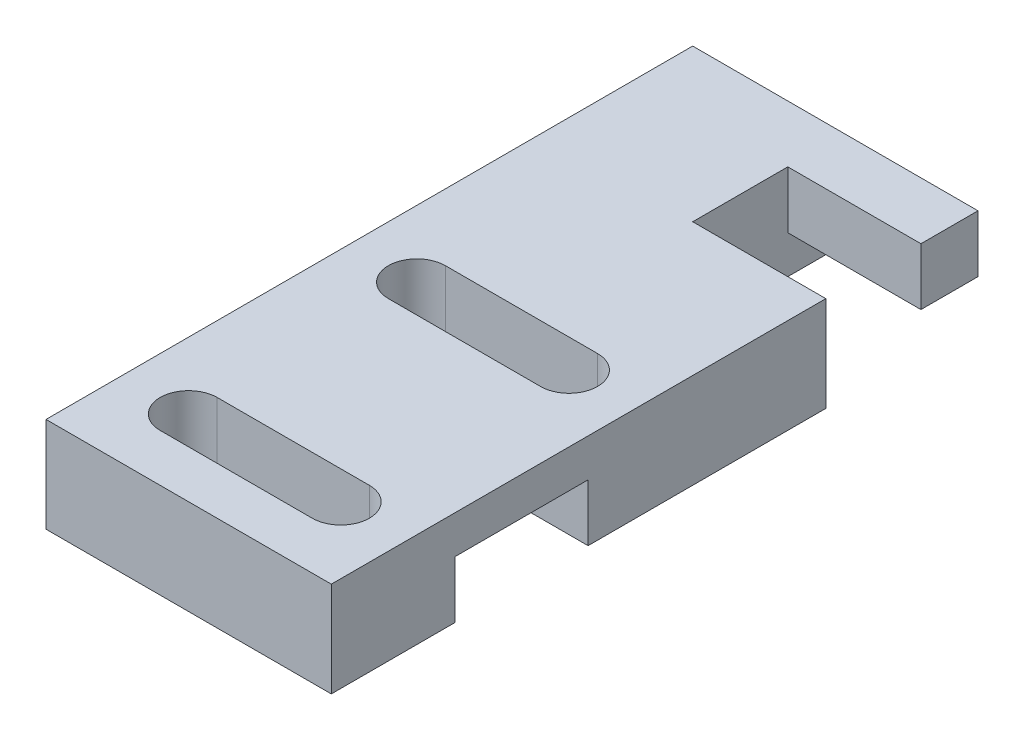
ISO-10303-21;
HEADER;
FILE_DESCRIPTION(('STEP AP214'),'2;1');
FILE_NAME('part.step','',(''),(''),'','','');
FILE_SCHEMA(('AUTOMOTIVE_DESIGN { 1 0 10303 214 1 1 1 1 }'));
ENDSEC;
DATA;
#1=APPLICATION_CONTEXT('core data for automotive mechanical design processes');
#2=APPLICATION_PROTOCOL_DEFINITION('international standard','automotive_design',2000,#1);
#3=PRODUCT_CONTEXT('',#1,'mechanical');
#4=PRODUCT('Part','Part','',(#3));
#5=PRODUCT_RELATED_PRODUCT_CATEGORY('part','',(#4));
#6=PRODUCT_DEFINITION_FORMATION('','',#4);
#7=PRODUCT_DEFINITION_CONTEXT('part definition',#1,'design');
#8=PRODUCT_DEFINITION('design','',#6,#7);
#9=PRODUCT_DEFINITION_SHAPE('','',#8);
#10=(LENGTH_UNIT() NAMED_UNIT(*) SI_UNIT(.MILLI.,.METRE.));
#11=(NAMED_UNIT(*) PLANE_ANGLE_UNIT() SI_UNIT($,.RADIAN.));
#12=(NAMED_UNIT(*) SI_UNIT($,.STERADIAN.) SOLID_ANGLE_UNIT());
#13=UNCERTAINTY_MEASURE_WITH_UNIT(LENGTH_MEASURE(1.E-05),#10,'distance_accuracy_value','');
#14=(GEOMETRIC_REPRESENTATION_CONTEXT(3) GLOBAL_UNCERTAINTY_ASSIGNED_CONTEXT((#13)) GLOBAL_UNIT_ASSIGNED_CONTEXT((#10,
#11,#12)) REPRESENTATION_CONTEXT('',''));
#15=CARTESIAN_POINT('',(0.,0.,0.));
#16=DIRECTION('',(0.,0.,1.));
#17=DIRECTION('',(1.,0.,0.));
#18=AXIS2_PLACEMENT_3D('',#15,#16,#17);
#19=CARTESIAN_POINT('',(0.,0.,0.));
#20=DIRECTION('',(0.,1.,0.));
#21=DIRECTION('',(0.,0.,1.));
#22=AXIS2_PLACEMENT_3D('',#19,#20,#21);
#23=PLANE('',#22);
#24=CARTESIAN_POINT('',(11.5,0.,-16.));
#25=DIRECTION('',(0.,1.,0.));
#26=DIRECTION('',(0.,0.,1.));
#27=AXIS2_PLACEMENT_3D('',#24,#25,#26);
#28=CIRCLE('',#27,1.5);
#29=CARTESIAN_POINT('',(11.5,0.,-14.5));
#30=VERTEX_POINT('',#29);
#31=CARTESIAN_POINT('',(11.5,0.,-17.5));
#32=VERTEX_POINT('',#31);
#33=EDGE_CURVE('E265',#30,#32,#28,.T.);
#34=ORIENTED_EDGE('',*,*,#33,.T.);
#35=DIRECTION('',(1.,0.,0.));
#36=VECTOR('',#35,1.);
#37=CARTESIAN_POINT('',(0.,0.,-17.5));
#38=LINE('',#37,#36);
#39=CARTESIAN_POINT('',(3.5,0.,-17.5));
#40=VERTEX_POINT('',#39);
#41=EDGE_CURVE('E279',#40,#32,#38,.T.);
#42=ORIENTED_EDGE('',*,*,#41,.F.);
#43=CARTESIAN_POINT('',(3.5,0.,-16.));
#44=DIRECTION('',(0.,1.,0.));
#45=DIRECTION('',(0.,0.,1.));
#46=AXIS2_PLACEMENT_3D('',#43,#44,#45);
#47=CIRCLE('',#46,1.5);
#48=CARTESIAN_POINT('',(3.5,0.,-14.5));
#49=VERTEX_POINT('',#48);
#50=EDGE_CURVE('E275',#40,#49,#47,.T.);
#51=ORIENTED_EDGE('',*,*,#50,.T.);
#52=DIRECTION('',(1.,0.,0.));
#53=VECTOR('',#52,1.);
#54=CARTESIAN_POINT('',(0.,0.,-14.5));
#55=LINE('',#54,#53);
#56=EDGE_CURVE('E257',#49,#30,#55,.T.);
#57=ORIENTED_EDGE('',*,*,#56,.T.);
#58=EDGE_LOOP('',(#34,#42,#51,#57));
#59=FACE_BOUND('',#58,.T.);
#60=DIRECTION('',(1.,0.,0.));
#61=VECTOR('',#60,1.);
#62=CARTESIAN_POINT('',(0.,0.,-34.));
#63=LINE('',#62,#61);
#64=CARTESIAN_POINT('',(0.,0.,-34.));
#65=VERTEX_POINT('',#64);
#66=CARTESIAN_POINT('',(8.,0.,-34.));
#67=VERTEX_POINT('',#66);
#68=EDGE_CURVE('E307',#65,#67,#63,.T.);
#69=ORIENTED_EDGE('',*,*,#68,.T.);
#70=DIRECTION('',(0.,0.,1.));
#71=VECTOR('',#70,1.);
#72=CARTESIAN_POINT('',(8.00000000000001,0.,0.));
#73=LINE('',#72,#71);
#74=CARTESIAN_POINT('',(8.,0.,-26.));
#75=VERTEX_POINT('',#74);
#76=EDGE_CURVE('E57',#67,#75,#73,.T.);
#77=ORIENTED_EDGE('',*,*,#76,.T.);
#78=DIRECTION('',(1.,0.,0.));
#79=VECTOR('',#78,1.);
#80=CARTESIAN_POINT('',(0.,0.,-26.));
#81=LINE('',#80,#79);
#82=CARTESIAN_POINT('',(15.,0.,-26.));
#83=VERTEX_POINT('',#82);
#84=EDGE_CURVE('E301',#75,#83,#81,.T.);
#85=ORIENTED_EDGE('',*,*,#84,.T.);
#86=DIRECTION('',(0.,0.,1.));
#87=VECTOR('',#86,1.);
#88=CARTESIAN_POINT('',(15.,0.,0.));
#89=LINE('',#88,#87);
#90=CARTESIAN_POINT('',(15.,0.,-13.5));
#91=VERTEX_POINT('',#90);
#92=EDGE_CURVE('E311',#83,#91,#89,.T.);
#93=ORIENTED_EDGE('',*,*,#92,.T.);
#94=DIRECTION('',(-1.,0.,0.));
#95=VECTOR('',#94,1.);
#96=CARTESIAN_POINT('',(15.,0.,-13.5));
#97=LINE('',#96,#95);
#98=CARTESIAN_POINT('',(0.,0.,-13.5));
#99=VERTEX_POINT('',#98);
#100=EDGE_CURVE('E407',#91,#99,#97,.T.);
#101=ORIENTED_EDGE('',*,*,#100,.T.);
#102=DIRECTION('',(0.,0.,-1.));
#103=VECTOR('',#102,1.);
#104=CARTESIAN_POINT('',(0.,0.,0.));
#105=LINE('',#104,#103);
#106=EDGE_CURVE('E315',#99,#65,#105,.T.);
#107=ORIENTED_EDGE('',*,*,#106,.T.);
#108=EDGE_LOOP('',(#69,#77,#85,#93,#101,#107));
#109=FACE_BOUND('',#108,.T.);
#110=ADVANCED_FACE('F41',(#59,#109),#23,.F.);
#111=CARTESIAN_POINT('',(0.,5.,-31.));
#112=DIRECTION('',(0.,0.,1.));
#113=DIRECTION('',(1.,0.,0.));
#114=AXIS2_PLACEMENT_3D('',#111,#112,#113);
#115=PLANE('',#114);
#116=DIRECTION('',(0.,-1.,0.));
#117=VECTOR('',#116,1.);
#118=CARTESIAN_POINT('',(8.,5.,-31.));
#119=LINE('',#118,#117);
#120=CARTESIAN_POINT('',(8.,5.,-31.));
#121=VERTEX_POINT('',#120);
#122=CARTESIAN_POINT('',(8.,2.,-31.));
#123=VERTEX_POINT('',#122);
#124=EDGE_CURVE('E216',#121,#123,#119,.T.);
#125=ORIENTED_EDGE('',*,*,#124,.T.);
#126=DIRECTION('',(-1.,0.,0.));
#127=VECTOR('',#126,1.);
#128=CARTESIAN_POINT('',(24.,2.,-31.));
#129=LINE('',#128,#127);
#130=CARTESIAN_POINT('',(15.,2.,-31.));
#131=VERTEX_POINT('',#130);
#132=EDGE_CURVE('E197',#131,#123,#129,.T.);
#133=ORIENTED_EDGE('',*,*,#132,.F.);
#134=DIRECTION('',(0.,-1.,0.));
#135=VECTOR('',#134,1.);
#136=CARTESIAN_POINT('',(15.,5.,-31.));
#137=LINE('',#136,#135);
#138=CARTESIAN_POINT('',(15.,5.,-31.));
#139=VERTEX_POINT('',#138);
#140=EDGE_CURVE('E210',#139,#131,#137,.T.);
#141=ORIENTED_EDGE('',*,*,#140,.F.);
#142=DIRECTION('',(-1.,0.,0.));
#143=VECTOR('',#142,1.);
#144=CARTESIAN_POINT('',(0.,5.,-31.));
#145=LINE('',#144,#143);
#146=EDGE_CURVE('E368',#139,#121,#145,.T.);
#147=ORIENTED_EDGE('',*,*,#146,.T.);
#148=EDGE_LOOP('',(#125,#133,#141,#147));
#149=FACE_BOUND('',#148,.T.);
#150=ADVANCED_FACE('F442',(#149),#115,.T.);
#151=CARTESIAN_POINT('',(15.,5.,0.));
#152=DIRECTION('',(1.,0.,0.));
#153=DIRECTION('',(0.,0.,-1.));
#154=AXIS2_PLACEMENT_3D('',#151,#152,#153);
#155=PLANE('',#154);
#156=ORIENTED_EDGE('',*,*,#140,.T.);
#157=DIRECTION('',(0.,0.,-1.));
#158=VECTOR('',#157,1.);
#159=CARTESIAN_POINT('',(15.,2.,0.));
#160=LINE('',#159,#158);
#161=CARTESIAN_POINT('',(15.,2.,-34.));
#162=VERTEX_POINT('',#161);
#163=EDGE_CURVE('E429',#131,#162,#160,.T.);
#164=ORIENTED_EDGE('',*,*,#163,.T.);
#165=DIRECTION('',(0.,-1.,0.));
#166=VECTOR('',#165,1.);
#167=CARTESIAN_POINT('',(15.,5.,-34.));
#168=LINE('',#167,#166);
#169=CARTESIAN_POINT('',(15.,5.,-34.));
#170=VERTEX_POINT('',#169);
#171=EDGE_CURVE('E203',#170,#162,#168,.T.);
#172=ORIENTED_EDGE('',*,*,#171,.F.);
#173=DIRECTION('',(0.,0.,1.));
#174=VECTOR('',#173,1.);
#175=CARTESIAN_POINT('',(15.,5.,0.));
#176=LINE('',#175,#174);
#177=EDGE_CURVE('E362',#170,#139,#176,.T.);
#178=ORIENTED_EDGE('',*,*,#177,.T.);
#179=EDGE_LOOP('',(#156,#164,#172,#178));
#180=FACE_BOUND('',#179,.T.);
#181=ADVANCED_FACE('F440',(#180),#155,.T.);
#182=CARTESIAN_POINT('',(0.,5.,-34.));
#183=DIRECTION('',(0.,0.,-1.));
#184=DIRECTION('',(-1.,0.,0.));
#185=AXIS2_PLACEMENT_3D('',#182,#183,#184);
#186=PLANE('',#185);
#187=ORIENTED_EDGE('',*,*,#171,.T.);
#188=DIRECTION('',(-1.,0.,0.));
#189=VECTOR('',#188,1.);
#190=CARTESIAN_POINT('',(0.,2.,-34.));
#191=LINE('',#190,#189);
#192=CARTESIAN_POINT('',(8.,2.,-34.));
#193=VERTEX_POINT('',#192);
#194=EDGE_CURVE('E11',#162,#193,#191,.T.);
#195=ORIENTED_EDGE('',*,*,#194,.T.);
#196=DIRECTION('',(0.,1.,0.));
#197=VECTOR('',#196,1.);
#198=CARTESIAN_POINT('',(8.,2.,-34.));
#199=LINE('',#198,#197);
#200=EDGE_CURVE('E183',#67,#193,#199,.T.);
#201=ORIENTED_EDGE('',*,*,#200,.F.);
#202=ORIENTED_EDGE('',*,*,#68,.F.);
#203=DIRECTION('',(0.,-1.,0.));
#204=VECTOR('',#203,1.);
#205=CARTESIAN_POINT('',(0.,5.,-34.));
#206=LINE('',#205,#204);
#207=CARTESIAN_POINT('',(0.,5.,-34.));
#208=VERTEX_POINT('',#207);
#209=EDGE_CURVE('E211',#208,#65,#206,.T.);
#210=ORIENTED_EDGE('',*,*,#209,.F.);
#211=DIRECTION('',(1.,0.,0.));
#212=VECTOR('',#211,1.);
#213=CARTESIAN_POINT('',(0.,5.,-34.));
#214=LINE('',#213,#212);
#215=EDGE_CURVE('E205',#208,#170,#214,.T.);
#216=ORIENTED_EDGE('',*,*,#215,.T.);
#217=EDGE_LOOP('',(#187,#195,#201,#202,#210,#216));
#218=FACE_BOUND('',#217,.T.);
#219=ADVANCED_FACE('F201',(#218),#186,.T.);
#220=CARTESIAN_POINT('',(0.,5.,-26.));
#221=DIRECTION('',(0.,0.,-1.));
#222=DIRECTION('',(-1.,0.,0.));
#223=AXIS2_PLACEMENT_3D('',#220,#221,#222);
#224=PLANE('',#223);
#225=ORIENTED_EDGE('',*,*,#84,.F.);
#226=DIRECTION('',(0.,-1.,0.));
#227=VECTOR('',#226,1.);
#228=CARTESIAN_POINT('',(8.,5.,-26.));
#229=LINE('',#228,#227);
#230=CARTESIAN_POINT('',(8.,5.,-26.));
#231=VERTEX_POINT('',#230);
#232=EDGE_CURVE('E50',#231,#75,#229,.T.);
#233=ORIENTED_EDGE('',*,*,#232,.F.);
#234=DIRECTION('',(1.,0.,0.));
#235=VECTOR('',#234,1.);
#236=CARTESIAN_POINT('',(0.,5.,-26.));
#237=LINE('',#236,#235);
#238=CARTESIAN_POINT('',(15.,5.,-26.));
#239=VERTEX_POINT('',#238);
#240=EDGE_CURVE('E376',#231,#239,#237,.T.);
#241=ORIENTED_EDGE('',*,*,#240,.T.);
#242=DIRECTION('',(0.,-1.,0.));
#243=VECTOR('',#242,1.);
#244=CARTESIAN_POINT('',(15.,5.,-26.));
#245=LINE('',#244,#243);
#246=EDGE_CURVE('E240',#239,#83,#245,.T.);
#247=ORIENTED_EDGE('',*,*,#246,.T.);
#248=EDGE_LOOP('',(#225,#233,#241,#247));
#249=FACE_BOUND('',#248,.T.);
#250=ADVANCED_FACE('F447',(#249),#224,.T.);
#251=CARTESIAN_POINT('',(8.00000000000001,5.,0.));
#252=DIRECTION('',(1.,0.,0.));
#253=DIRECTION('',(0.,0.,-1.));
#254=AXIS2_PLACEMENT_3D('',#251,#252,#253);
#255=PLANE('',#254);
#256=ORIENTED_EDGE('',*,*,#76,.F.);
#257=ORIENTED_EDGE('',*,*,#200,.T.);
#258=DIRECTION('',(0.,0.,1.));
#259=VECTOR('',#258,1.);
#260=CARTESIAN_POINT('',(8.,2.,-31.));
#261=LINE('',#260,#259);
#262=EDGE_CURVE('E186',#193,#123,#261,.T.);
#263=ORIENTED_EDGE('',*,*,#262,.T.);
#264=ORIENTED_EDGE('',*,*,#124,.F.);
#265=DIRECTION('',(0.,0.,1.));
#266=VECTOR('',#265,1.);
#267=CARTESIAN_POINT('',(8.00000000000001,5.,0.));
#268=LINE('',#267,#266);
#269=EDGE_CURVE('E372',#121,#231,#268,.T.);
#270=ORIENTED_EDGE('',*,*,#269,.T.);
#271=ORIENTED_EDGE('',*,*,#232,.T.);
#272=EDGE_LOOP('',(#256,#257,#263,#264,#270,#271));
#273=FACE_BOUND('',#272,.T.);
#274=ADVANCED_FACE('F185',(#273),#255,.T.);
#275=CARTESIAN_POINT('',(0.,5.,0.));
#276=DIRECTION('',(-1.,0.,0.));
#277=DIRECTION('',(0.,0.,1.));
#278=AXIS2_PLACEMENT_3D('',#275,#276,#277);
#279=PLANE('',#278);
#280=DIRECTION('',(0.,-1.,0.));
#281=VECTOR('',#280,1.);
#282=CARTESIAN_POINT('',(0.,3.,-13.5));
#283=LINE('',#282,#281);
#284=CARTESIAN_POINT('',(0.,3.,-13.5));
#285=VERTEX_POINT('',#284);
#286=EDGE_CURVE('E426',#285,#99,#283,.T.);
#287=ORIENTED_EDGE('',*,*,#286,.F.);
#288=DIRECTION('',(0.,0.,-1.));
#289=VECTOR('',#288,1.);
#290=CARTESIAN_POINT('',(0.,3.,-13.5));
#291=LINE('',#290,#289);
#292=CARTESIAN_POINT('',(0.,3.,-6.5));
#293=VERTEX_POINT('',#292);
#294=EDGE_CURVE('E419',#293,#285,#291,.T.);
#295=ORIENTED_EDGE('',*,*,#294,.F.);
#296=DIRECTION('',(0.,1.,0.));
#297=VECTOR('',#296,1.);
#298=CARTESIAN_POINT('',(0.,3.,-6.5));
#299=LINE('',#298,#297);
#300=CARTESIAN_POINT('',(0.,0.,-6.5));
#301=VERTEX_POINT('',#300);
#302=EDGE_CURVE('E344',#301,#293,#299,.T.);
#303=ORIENTED_EDGE('',*,*,#302,.F.);
#304=CARTESIAN_POINT('',(0.,0.,0.));
#305=VERTEX_POINT('',#304);
#306=EDGE_CURVE('E316',#305,#301,#105,.T.);
#307=ORIENTED_EDGE('',*,*,#306,.F.);
#308=DIRECTION('',(0.,-1.,0.));
#309=VECTOR('',#308,1.);
#310=CARTESIAN_POINT('',(0.,5.,0.));
#311=LINE('',#310,#309);
#312=CARTESIAN_POINT('',(0.,5.,0.));
#313=VERTEX_POINT('',#312);
#314=EDGE_CURVE('E219',#313,#305,#311,.T.);
#315=ORIENTED_EDGE('',*,*,#314,.F.);
#316=DIRECTION('',(0.,0.,-1.));
#317=VECTOR('',#316,1.);
#318=CARTESIAN_POINT('',(0.,5.,0.));
#319=LINE('',#318,#317);
#320=EDGE_CURVE('E357',#313,#208,#319,.T.);
#321=ORIENTED_EDGE('',*,*,#320,.T.);
#322=ORIENTED_EDGE('',*,*,#209,.T.);
#323=ORIENTED_EDGE('',*,*,#106,.F.);
#324=EDGE_LOOP('',(#287,#295,#303,#307,#315,#321,#322,#323));
#325=FACE_BOUND('',#324,.T.);
#326=ADVANCED_FACE('F341',(#325),#279,.T.);
#327=CARTESIAN_POINT('',(0.,5.,0.));
#328=DIRECTION('',(0.,0.,1.));
#329=DIRECTION('',(1.,0.,0.));
#330=AXIS2_PLACEMENT_3D('',#327,#328,#329);
#331=PLANE('',#330);
#332=DIRECTION('',(-1.,0.,0.));
#333=VECTOR('',#332,1.);
#334=CARTESIAN_POINT('',(0.,0.,0.));
#335=LINE('',#334,#333);
#336=CARTESIAN_POINT('',(15.,0.,0.));
#337=VERTEX_POINT('',#336);
#338=EDGE_CURVE('E312',#337,#305,#335,.T.);
#339=ORIENTED_EDGE('',*,*,#338,.F.);
#340=DIRECTION('',(0.,-1.,0.));
#341=VECTOR('',#340,1.);
#342=CARTESIAN_POINT('',(15.,5.,0.));
#343=LINE('',#342,#341);
#344=CARTESIAN_POINT('',(15.,5.,0.));
#345=VERTEX_POINT('',#344);
#346=EDGE_CURVE('E325',#345,#337,#343,.T.);
#347=ORIENTED_EDGE('',*,*,#346,.F.);
#348=DIRECTION('',(-1.,0.,0.));
#349=VECTOR('',#348,1.);
#350=CARTESIAN_POINT('',(0.,5.,0.));
#351=LINE('',#350,#349);
#352=EDGE_CURVE('E335',#345,#313,#351,.T.);
#353=ORIENTED_EDGE('',*,*,#352,.T.);
#354=ORIENTED_EDGE('',*,*,#314,.T.);
#355=EDGE_LOOP('',(#339,#347,#353,#354));
#356=FACE_BOUND('',#355,.T.);
#357=ADVANCED_FACE('F333',(#356),#331,.T.);
#358=CARTESIAN_POINT('',(11.5,5.,-4.));
#359=DIRECTION('',(0.,-1.,0.));
#360=DIRECTION('',(0.,0.,-1.));
#361=AXIS2_PLACEMENT_3D('',#358,#359,#360);
#362=CYLINDRICAL_SURFACE('',#361,1.5);
#363=CARTESIAN_POINT('',(11.5,0.,-4.));
#364=DIRECTION('',(0.,1.,0.));
#365=DIRECTION('',(0.,0.,1.));
#366=AXIS2_PLACEMENT_3D('',#363,#364,#365);
#367=CIRCLE('',#366,1.5);
#368=CARTESIAN_POINT('',(11.5,0.,-2.5));
#369=VERTEX_POINT('',#368);
#370=CARTESIAN_POINT('',(11.5,0.,-5.5));
#371=VERTEX_POINT('',#370);
#372=EDGE_CURVE('E285',#369,#371,#367,.T.);
#373=ORIENTED_EDGE('',*,*,#372,.F.);
#374=DIRECTION('',(0.,-1.,0.));
#375=VECTOR('',#374,1.);
#376=CARTESIAN_POINT('',(11.5,5.,-2.5));
#377=LINE('',#376,#375);
#378=CARTESIAN_POINT('',(11.5,5.,-2.5));
#379=VERTEX_POINT('',#378);
#380=EDGE_CURVE('E237',#379,#369,#377,.T.);
#381=ORIENTED_EDGE('',*,*,#380,.F.);
#382=CARTESIAN_POINT('',(11.5,5.,-4.));
#383=DIRECTION('',(0.,1.,0.));
#384=DIRECTION('',(0.,0.,1.));
#385=AXIS2_PLACEMENT_3D('',#382,#383,#384);
#386=CIRCLE('',#385,1.5);
#387=CARTESIAN_POINT('',(11.5,5.,-5.5));
#388=VERTEX_POINT('',#387);
#389=EDGE_CURVE('E391',#379,#388,#386,.T.);
#390=ORIENTED_EDGE('',*,*,#389,.T.);
#391=DIRECTION('',(0.,-1.,0.));
#392=VECTOR('',#391,1.);
#393=CARTESIAN_POINT('',(11.5,5.,-5.5));
#394=LINE('',#393,#392);
#395=EDGE_CURVE('E227',#388,#371,#394,.T.);
#396=ORIENTED_EDGE('',*,*,#395,.T.);
#397=EDGE_LOOP('',(#373,#381,#390,#396));
#398=FACE_BOUND('',#397,.T.);
#399=ADVANCED_FACE('F489',(#398),#362,.F.);
#400=CARTESIAN_POINT('',(0.,5.,-2.49999999999999));
#401=DIRECTION('',(0.,0.,-1.));
#402=DIRECTION('',(-1.,0.,0.));
#403=AXIS2_PLACEMENT_3D('',#400,#401,#402);
#404=PLANE('',#403);
#405=DIRECTION('',(1.,0.,0.));
#406=VECTOR('',#405,1.);
#407=CARTESIAN_POINT('',(0.,0.,-2.49999999999999));
#408=LINE('',#407,#406);
#409=CARTESIAN_POINT('',(3.5,0.,-2.5));
#410=VERTEX_POINT('',#409);
#411=EDGE_CURVE('E289',#410,#369,#408,.T.);
#412=ORIENTED_EDGE('',*,*,#411,.F.);
#413=DIRECTION('',(0.,-1.,0.));
#414=VECTOR('',#413,1.);
#415=CARTESIAN_POINT('',(3.5,5.,-2.5));
#416=LINE('',#415,#414);
#417=CARTESIAN_POINT('',(3.5,5.,-2.5));
#418=VERTEX_POINT('',#417);
#419=EDGE_CURVE('E234',#418,#410,#416,.T.);
#420=ORIENTED_EDGE('',*,*,#419,.F.);
#421=DIRECTION('',(1.,0.,0.));
#422=VECTOR('',#421,1.);
#423=CARTESIAN_POINT('',(0.,5.,-2.49999999999999));
#424=LINE('',#423,#422);
#425=EDGE_CURVE('E387',#418,#379,#424,.T.);
#426=ORIENTED_EDGE('',*,*,#425,.T.);
#427=ORIENTED_EDGE('',*,*,#380,.T.);
#428=EDGE_LOOP('',(#412,#420,#426,#427));
#429=FACE_BOUND('',#428,.T.);
#430=ADVANCED_FACE('F500',(#429),#404,.T.);
#431=CARTESIAN_POINT('',(3.5,5.,-4.));
#432=DIRECTION('',(0.,-1.,0.));
#433=DIRECTION('',(0.,0.,-1.));
#434=AXIS2_PLACEMENT_3D('',#431,#432,#433);
#435=CYLINDRICAL_SURFACE('',#434,1.5);
#436=CARTESIAN_POINT('',(3.5,0.,-4.));
#437=DIRECTION('',(0.,1.,0.));
#438=DIRECTION('',(0.,0.,1.));
#439=AXIS2_PLACEMENT_3D('',#436,#437,#438);
#440=CIRCLE('',#439,1.5);
#441=CARTESIAN_POINT('',(3.5,0.,-5.5));
#442=VERTEX_POINT('',#441);
#443=EDGE_CURVE('E293',#442,#410,#440,.T.);
#444=ORIENTED_EDGE('',*,*,#443,.F.);
#445=DIRECTION('',(0.,-1.,0.));
#446=VECTOR('',#445,1.);
#447=CARTESIAN_POINT('',(3.5,5.,-5.5));
#448=LINE('',#447,#446);
#449=CARTESIAN_POINT('',(3.5,5.,-5.5));
#450=VERTEX_POINT('',#449);
#451=EDGE_CURVE('E230',#450,#442,#448,.T.);
#452=ORIENTED_EDGE('',*,*,#451,.F.);
#453=CARTESIAN_POINT('',(3.5,5.,-4.));
#454=DIRECTION('',(0.,1.,0.));
#455=DIRECTION('',(0.,0.,1.));
#456=AXIS2_PLACEMENT_3D('',#453,#454,#455);
#457=CIRCLE('',#456,1.5);
#458=EDGE_CURVE('E383',#450,#418,#457,.T.);
#459=ORIENTED_EDGE('',*,*,#458,.T.);
#460=ORIENTED_EDGE('',*,*,#419,.T.);
#461=EDGE_LOOP('',(#444,#452,#459,#460));
#462=FACE_BOUND('',#461,.T.);
#463=ADVANCED_FACE('F497',(#462),#435,.F.);
#464=CARTESIAN_POINT('',(11.5,5.,-16.));
#465=DIRECTION('',(0.,-1.,0.));
#466=DIRECTION('',(0.,0.,-1.));
#467=AXIS2_PLACEMENT_3D('',#464,#465,#466);
#468=CYLINDRICAL_SURFACE('',#467,1.5);
#469=ORIENTED_EDGE('',*,*,#33,.F.);
#470=DIRECTION('',(0.,-1.,0.));
#471=VECTOR('',#470,1.);
#472=CARTESIAN_POINT('',(11.5,5.,-14.5));
#473=LINE('',#472,#471);
#474=CARTESIAN_POINT('',(11.5,5.,-14.5));
#475=VERTEX_POINT('',#474);
#476=EDGE_CURVE('E231',#475,#30,#473,.T.);
#477=ORIENTED_EDGE('',*,*,#476,.F.);
#478=CARTESIAN_POINT('',(11.5,5.,-16.));
#479=DIRECTION('',(0.,1.,0.));
#480=DIRECTION('',(0.,0.,1.));
#481=AXIS2_PLACEMENT_3D('',#478,#479,#480);
#482=CIRCLE('',#481,1.5);
#483=CARTESIAN_POINT('',(11.5,5.,-17.5));
#484=VERTEX_POINT('',#483);
#485=EDGE_CURVE('E404',#475,#484,#482,.T.);
#486=ORIENTED_EDGE('',*,*,#485,.T.);
#487=DIRECTION('',(0.,-1.,0.));
#488=VECTOR('',#487,1.);
#489=CARTESIAN_POINT('',(11.5,5.,-17.5));
#490=LINE('',#489,#488);
#491=EDGE_CURVE('E241',#484,#32,#490,.T.);
#492=ORIENTED_EDGE('',*,*,#491,.T.);
#493=EDGE_LOOP('',(#469,#477,#486,#492));
#494=FACE_BOUND('',#493,.T.);
#495=ADVANCED_FACE('F43',(#494),#468,.F.);
#496=CARTESIAN_POINT('',(0.,5.,-14.5));
#497=DIRECTION('',(0.,0.,-1.));
#498=DIRECTION('',(-1.,0.,0.));
#499=AXIS2_PLACEMENT_3D('',#496,#497,#498);
#500=PLANE('',#499);
#501=ORIENTED_EDGE('',*,*,#56,.F.);
#502=DIRECTION('',(0.,-1.,0.));
#503=VECTOR('',#502,1.);
#504=CARTESIAN_POINT('',(3.5,5.,-14.5));
#505=LINE('',#504,#503);
#506=CARTESIAN_POINT('',(3.5,5.,-14.5));
#507=VERTEX_POINT('',#506);
#508=EDGE_CURVE('E248',#507,#49,#505,.T.);
#509=ORIENTED_EDGE('',*,*,#508,.F.);
#510=DIRECTION('',(1.,0.,0.));
#511=VECTOR('',#510,1.);
#512=CARTESIAN_POINT('',(0.,5.,-14.5));
#513=LINE('',#512,#511);
#514=EDGE_CURVE('E260',#507,#475,#513,.T.);
#515=ORIENTED_EDGE('',*,*,#514,.T.);
#516=ORIENTED_EDGE('',*,*,#476,.T.);
#517=EDGE_LOOP('',(#501,#509,#515,#516));
#518=FACE_BOUND('',#517,.T.);
#519=ADVANCED_FACE('F255',(#518),#500,.T.);
#520=CARTESIAN_POINT('',(3.5,5.,-16.));
#521=DIRECTION('',(0.,-1.,0.));
#522=DIRECTION('',(0.,0.,-1.));
#523=AXIS2_PLACEMENT_3D('',#520,#521,#522);
#524=CYLINDRICAL_SURFACE('',#523,1.5);
#525=ORIENTED_EDGE('',*,*,#50,.F.);
#526=DIRECTION('',(0.,-1.,0.));
#527=VECTOR('',#526,1.);
#528=CARTESIAN_POINT('',(3.5,5.,-17.5));
#529=LINE('',#528,#527);
#530=CARTESIAN_POINT('',(3.5,5.,-17.5));
#531=VERTEX_POINT('',#530);
#532=EDGE_CURVE('E244',#531,#40,#529,.T.);
#533=ORIENTED_EDGE('',*,*,#532,.F.);
#534=CARTESIAN_POINT('',(3.5,5.,-16.));
#535=DIRECTION('',(0.,1.,0.));
#536=DIRECTION('',(0.,0.,1.));
#537=AXIS2_PLACEMENT_3D('',#534,#535,#536);
#538=CIRCLE('',#537,1.5);
#539=EDGE_CURVE('E398',#531,#507,#538,.T.);
#540=ORIENTED_EDGE('',*,*,#539,.T.);
#541=ORIENTED_EDGE('',*,*,#508,.T.);
#542=EDGE_LOOP('',(#525,#533,#540,#541));
#543=FACE_BOUND('',#542,.T.);
#544=ADVANCED_FACE('F516',(#543),#524,.F.);
#545=CARTESIAN_POINT('',(0.,5.,-5.5));
#546=DIRECTION('',(0.,0.,-1.));
#547=DIRECTION('',(-1.,0.,0.));
#548=AXIS2_PLACEMENT_3D('',#545,#546,#547);
#549=PLANE('',#548);
#550=DIRECTION('',(1.,0.,0.));
#551=VECTOR('',#550,1.);
#552=CARTESIAN_POINT('',(0.,0.,-5.5));
#553=LINE('',#552,#551);
#554=EDGE_CURVE('E297',#442,#371,#553,.T.);
#555=ORIENTED_EDGE('',*,*,#554,.T.);
#556=ORIENTED_EDGE('',*,*,#395,.F.);
#557=DIRECTION('',(1.,0.,0.));
#558=VECTOR('',#557,1.);
#559=CARTESIAN_POINT('',(0.,5.,-5.5));
#560=LINE('',#559,#558);
#561=EDGE_CURVE('E380',#450,#388,#560,.T.);
#562=ORIENTED_EDGE('',*,*,#561,.F.);
#563=ORIENTED_EDGE('',*,*,#451,.T.);
#564=EDGE_LOOP('',(#555,#556,#562,#563));
#565=FACE_BOUND('',#564,.T.);
#566=ADVANCED_FACE('F494',(#565),#549,.F.);
#567=CARTESIAN_POINT('',(0.,5.,-17.5));
#568=DIRECTION('',(0.,0.,-1.));
#569=DIRECTION('',(-1.,0.,0.));
#570=AXIS2_PLACEMENT_3D('',#567,#568,#569);
#571=PLANE('',#570);
#572=ORIENTED_EDGE('',*,*,#41,.T.);
#573=ORIENTED_EDGE('',*,*,#491,.F.);
#574=DIRECTION('',(1.,0.,0.));
#575=VECTOR('',#574,1.);
#576=CARTESIAN_POINT('',(0.,5.,-17.5));
#577=LINE('',#576,#575);
#578=EDGE_CURVE('E395',#531,#484,#577,.T.);
#579=ORIENTED_EDGE('',*,*,#578,.F.);
#580=ORIENTED_EDGE('',*,*,#532,.T.);
#581=EDGE_LOOP('',(#572,#573,#579,#580));
#582=FACE_BOUND('',#581,.T.);
#583=ADVANCED_FACE('F512',(#582),#571,.F.);
#584=DIRECTION('',(0.,-1.,0.));
#585=VECTOR('',#584,1.);
#586=CARTESIAN_POINT('',(15.,3.,-13.5));
#587=LINE('',#586,#585);
#588=CARTESIAN_POINT('',(15.,3.,-13.5));
#589=VERTEX_POINT('',#588);
#590=EDGE_CURVE('E423',#589,#91,#587,.T.);
#591=ORIENTED_EDGE('',*,*,#590,.T.);
#592=ORIENTED_EDGE('',*,*,#92,.F.);
#593=ORIENTED_EDGE('',*,*,#246,.F.);
#594=EDGE_CURVE('E245',#239,#345,#176,.T.);
#595=ORIENTED_EDGE('',*,*,#594,.T.);
#596=ORIENTED_EDGE('',*,*,#346,.T.);
#597=CARTESIAN_POINT('',(15.,0.,-6.5));
#598=VERTEX_POINT('',#597);
#599=EDGE_CURVE('E308',#598,#337,#89,.T.);
#600=ORIENTED_EDGE('',*,*,#599,.F.);
#601=DIRECTION('',(0.,1.,0.));
#602=VECTOR('',#601,1.);
#603=CARTESIAN_POINT('',(15.,3.,-6.5));
#604=LINE('',#603,#602);
#605=CARTESIAN_POINT('',(15.,3.,-6.5));
#606=VERTEX_POINT('',#605);
#607=EDGE_CURVE('E65',#598,#606,#604,.T.);
#608=ORIENTED_EDGE('',*,*,#607,.T.);
#609=DIRECTION('',(0.,0.,-1.));
#610=VECTOR('',#609,1.);
#611=CARTESIAN_POINT('',(15.,3.,-13.5));
#612=LINE('',#611,#610);
#613=EDGE_CURVE('E411',#606,#589,#612,.T.);
#614=ORIENTED_EDGE('',*,*,#613,.T.);
#615=EDGE_LOOP('',(#591,#592,#593,#595,#596,#600,#608,#614));
#616=FACE_BOUND('',#615,.T.);
#617=ADVANCED_FACE('F352',(#616),#155,.T.);
#618=CARTESIAN_POINT('',(0.,5.,0.));
#619=DIRECTION('',(0.,1.,0.));
#620=DIRECTION('',(0.,0.,1.));
#621=AXIS2_PLACEMENT_3D('',#618,#619,#620);
#622=PLANE('',#621);
#623=ORIENTED_EDGE('',*,*,#485,.F.);
#624=ORIENTED_EDGE('',*,*,#514,.F.);
#625=ORIENTED_EDGE('',*,*,#539,.F.);
#626=ORIENTED_EDGE('',*,*,#578,.T.);
#627=EDGE_LOOP('',(#623,#624,#625,#626));
#628=FACE_BOUND('',#627,.T.);
#629=ORIENTED_EDGE('',*,*,#389,.F.);
#630=ORIENTED_EDGE('',*,*,#425,.F.);
#631=ORIENTED_EDGE('',*,*,#458,.F.);
#632=ORIENTED_EDGE('',*,*,#561,.T.);
#633=EDGE_LOOP('',(#629,#630,#631,#632));
#634=FACE_BOUND('',#633,.T.);
#635=ORIENTED_EDGE('',*,*,#240,.F.);
#636=ORIENTED_EDGE('',*,*,#269,.F.);
#637=ORIENTED_EDGE('',*,*,#146,.F.);
#638=ORIENTED_EDGE('',*,*,#177,.F.);
#639=ORIENTED_EDGE('',*,*,#215,.F.);
#640=ORIENTED_EDGE('',*,*,#320,.F.);
#641=ORIENTED_EDGE('',*,*,#352,.F.);
#642=ORIENTED_EDGE('',*,*,#594,.F.);
#643=EDGE_LOOP('',(#635,#636,#637,#638,#639,#640,#641,#642));
#644=FACE_BOUND('',#643,.T.);
#645=ADVANCED_FACE('F356',(#628,#634,#644),#622,.T.);
#646=ORIENTED_EDGE('',*,*,#372,.T.);
#647=ORIENTED_EDGE('',*,*,#554,.F.);
#648=ORIENTED_EDGE('',*,*,#443,.T.);
#649=ORIENTED_EDGE('',*,*,#411,.T.);
#650=EDGE_LOOP('',(#646,#647,#648,#649));
#651=FACE_BOUND('',#650,.T.);
#652=ORIENTED_EDGE('',*,*,#306,.T.);
#653=DIRECTION('',(-1.,0.,0.));
#654=VECTOR('',#653,1.);
#655=CARTESIAN_POINT('',(15.,0.,-6.5));
#656=LINE('',#655,#654);
#657=EDGE_CURVE('E348',#598,#301,#656,.T.);
#658=ORIENTED_EDGE('',*,*,#657,.F.);
#659=ORIENTED_EDGE('',*,*,#599,.T.);
#660=ORIENTED_EDGE('',*,*,#338,.T.);
#661=EDGE_LOOP('',(#652,#658,#659,#660));
#662=FACE_BOUND('',#661,.T.);
#663=ADVANCED_FACE('F346',(#651,#662),#23,.F.);
#664=CARTESIAN_POINT('',(15.,3.,-13.5));
#665=DIRECTION('',(0.,0.,-1.));
#666=DIRECTION('',(0.,1.,0.));
#667=AXIS2_PLACEMENT_3D('',#664,#665,#666);
#668=PLANE('',#667);
#669=ORIENTED_EDGE('',*,*,#286,.T.);
#670=ORIENTED_EDGE('',*,*,#100,.F.);
#671=ORIENTED_EDGE('',*,*,#590,.F.);
#672=DIRECTION('',(-1.,0.,0.));
#673=VECTOR('',#672,1.);
#674=CARTESIAN_POINT('',(15.,3.,-13.5));
#675=LINE('',#674,#673);
#676=EDGE_CURVE('E271',#589,#285,#675,.T.);
#677=ORIENTED_EDGE('',*,*,#676,.T.);
#678=EDGE_LOOP('',(#669,#670,#671,#677));
#679=FACE_BOUND('',#678,.T.);
#680=ADVANCED_FACE('F456',(#679),#668,.F.);
#681=CARTESIAN_POINT('',(15.,3.,-13.5));
#682=DIRECTION('',(0.,1.,0.));
#683=DIRECTION('',(0.,0.,1.));
#684=AXIS2_PLACEMENT_3D('',#681,#682,#683);
#685=PLANE('',#684);
#686=ORIENTED_EDGE('',*,*,#294,.T.);
#687=ORIENTED_EDGE('',*,*,#676,.F.);
#688=ORIENTED_EDGE('',*,*,#613,.F.);
#689=DIRECTION('',(-1.,0.,0.));
#690=VECTOR('',#689,1.);
#691=CARTESIAN_POINT('',(15.,3.,-6.5));
#692=LINE('',#691,#690);
#693=EDGE_CURVE('E414',#606,#293,#692,.T.);
#694=ORIENTED_EDGE('',*,*,#693,.T.);
#695=EDGE_LOOP('',(#686,#687,#688,#694));
#696=FACE_BOUND('',#695,.T.);
#697=ADVANCED_FACE('F458',(#696),#685,.F.);
#698=CARTESIAN_POINT('',(15.,3.,-6.5));
#699=DIRECTION('',(0.,0.,1.));
#700=DIRECTION('',(1.,0.,0.));
#701=AXIS2_PLACEMENT_3D('',#698,#699,#700);
#702=PLANE('',#701);
#703=ORIENTED_EDGE('',*,*,#302,.T.);
#704=ORIENTED_EDGE('',*,*,#693,.F.);
#705=ORIENTED_EDGE('',*,*,#607,.F.);
#706=ORIENTED_EDGE('',*,*,#657,.T.);
#707=EDGE_LOOP('',(#703,#704,#705,#706));
#708=FACE_BOUND('',#707,.T.);
#709=ADVANCED_FACE('F459',(#708),#702,.F.);
#710=CARTESIAN_POINT('',(24.,2.,-31.));
#711=DIRECTION('',(0.,-1.,0.));
#712=DIRECTION('',(0.,0.,-1.));
#713=AXIS2_PLACEMENT_3D('',#710,#711,#712);
#714=PLANE('',#713);
#715=ORIENTED_EDGE('',*,*,#132,.T.);
#716=ORIENTED_EDGE('',*,*,#262,.F.);
#717=ORIENTED_EDGE('',*,*,#194,.F.);
#718=ORIENTED_EDGE('',*,*,#163,.F.);
#719=EDGE_LOOP('',(#715,#716,#717,#718));
#720=FACE_BOUND('',#719,.T.);
#721=ADVANCED_FACE('F194',(#720),#714,.T.);
#722=CLOSED_SHELL('',(#110,#150,#181,#219,#250,#274,#326,#357,#399,#430,#463,#495,#519,#544,
#566,#583,#617,#645,#663,#680,#697,#709,#721));
#723=MANIFOLD_SOLID_BREP('B2',#722);
#724=ADVANCED_BREP_SHAPE_REPRESENTATION('',(#18,#723),#14);
#725=SHAPE_DEFINITION_REPRESENTATION(#9,#724);
ENDSEC;
END-ISO-10303-21;
